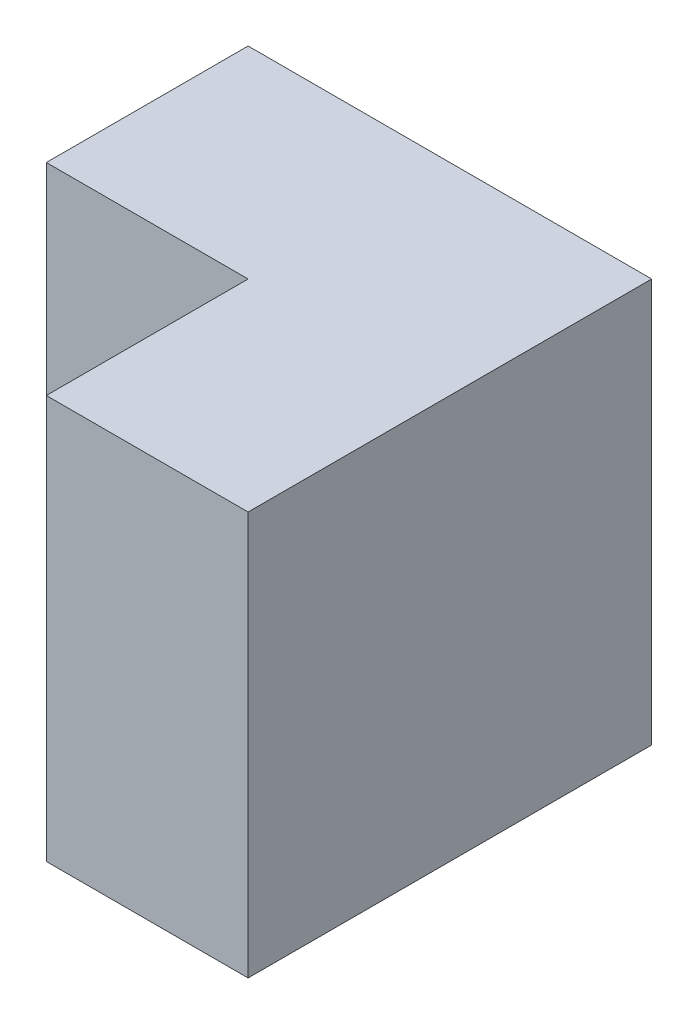
ISO-10303-21;
HEADER;
FILE_DESCRIPTION(('STEP AP214'),'2;1');
FILE_NAME('part.step','',(''),(''),'','','');
FILE_SCHEMA(('AUTOMOTIVE_DESIGN { 1 0 10303 214 1 1 1 1 }'));
ENDSEC;
DATA;
#1=APPLICATION_CONTEXT('core data for automotive mechanical design processes');
#2=APPLICATION_PROTOCOL_DEFINITION('international standard','automotive_design',2000,#1);
#3=PRODUCT_CONTEXT('',#1,'mechanical');
#4=PRODUCT('Part','Part','',(#3));
#5=PRODUCT_RELATED_PRODUCT_CATEGORY('part','',(#4));
#6=PRODUCT_DEFINITION_FORMATION('','',#4);
#7=PRODUCT_DEFINITION_CONTEXT('part definition',#1,'design');
#8=PRODUCT_DEFINITION('design','',#6,#7);
#9=PRODUCT_DEFINITION_SHAPE('','',#8);
#10=(LENGTH_UNIT() NAMED_UNIT(*) SI_UNIT(.MILLI.,.METRE.));
#11=(NAMED_UNIT(*) PLANE_ANGLE_UNIT() SI_UNIT($,.RADIAN.));
#12=(NAMED_UNIT(*) SI_UNIT($,.STERADIAN.) SOLID_ANGLE_UNIT());
#13=UNCERTAINTY_MEASURE_WITH_UNIT(LENGTH_MEASURE(1.E-05),#10,'distance_accuracy_value','');
#14=(GEOMETRIC_REPRESENTATION_CONTEXT(3) GLOBAL_UNCERTAINTY_ASSIGNED_CONTEXT((#13)) GLOBAL_UNIT_ASSIGNED_CONTEXT((#10,
#11,#12)) REPRESENTATION_CONTEXT('',''));
#15=CARTESIAN_POINT('',(0.,0.,0.));
#16=DIRECTION('',(0.,0.,1.));
#17=DIRECTION('',(1.,0.,0.));
#18=AXIS2_PLACEMENT_3D('',#15,#16,#17);
#19=CARTESIAN_POINT('',(0.,0.,20.));
#20=DIRECTION('',(1.,0.,0.));
#21=DIRECTION('',(0.,0.,-1.));
#22=AXIS2_PLACEMENT_3D('',#19,#20,#21);
#23=PLANE('',#22);
#24=DIRECTION('',(0.,-1.,0.));
#25=VECTOR('',#24,1.);
#26=CARTESIAN_POINT('',(0.,20.,10.));
#27=LINE('',#26,#25);
#28=CARTESIAN_POINT('',(0.,20.,10.));
#29=VERTEX_POINT('',#28);
#30=CARTESIAN_POINT('',(0.,0.,10.));
#31=VERTEX_POINT('',#30);
#32=EDGE_CURVE('E81',#29,#31,#27,.T.);
#33=ORIENTED_EDGE('',*,*,#32,.F.);
#34=DIRECTION('',(0.,0.,-1.));
#35=VECTOR('',#34,1.);
#36=CARTESIAN_POINT('',(0.,20.,20.));
#37=LINE('',#36,#35);
#38=CARTESIAN_POINT('',(0.,20.,0.));
#39=VERTEX_POINT('',#38);
#40=EDGE_CURVE('E75',#29,#39,#37,.T.);
#41=ORIENTED_EDGE('',*,*,#40,.T.);
#42=DIRECTION('',(0.,-1.,0.));
#43=VECTOR('',#42,1.);
#44=CARTESIAN_POINT('',(0.,0.,0.));
#45=LINE('',#44,#43);
#46=CARTESIAN_POINT('',(0.,0.,0.));
#47=VERTEX_POINT('',#46);
#48=EDGE_CURVE('E79',#39,#47,#45,.T.);
#49=ORIENTED_EDGE('',*,*,#48,.T.);
#50=DIRECTION('',(0.,0.,-1.));
#51=VECTOR('',#50,1.);
#52=CARTESIAN_POINT('',(0.,0.,20.));
#53=LINE('',#52,#51);
#54=EDGE_CURVE('E11',#31,#47,#53,.T.);
#55=ORIENTED_EDGE('',*,*,#54,.F.);
#56=EDGE_LOOP('',(#33,#41,#49,#55));
#57=FACE_BOUND('',#56,.T.);
#58=ADVANCED_FACE('F33',(#57),#23,.F.);
#59=CARTESIAN_POINT('',(0.,0.,20.));
#60=DIRECTION('',(0.,1.,0.));
#61=DIRECTION('',(0.,0.,1.));
#62=AXIS2_PLACEMENT_3D('',#59,#60,#61);
#63=PLANE('',#62);
#64=DIRECTION('',(1.,0.,0.));
#65=VECTOR('',#64,1.);
#66=CARTESIAN_POINT('',(0.,0.,20.));
#67=LINE('',#66,#65);
#68=CARTESIAN_POINT('',(10.,0.,20.));
#69=VERTEX_POINT('',#68);
#70=CARTESIAN_POINT('',(20.,0.,20.));
#71=VERTEX_POINT('',#70);
#72=EDGE_CURVE('E94',#69,#71,#67,.T.);
#73=ORIENTED_EDGE('',*,*,#72,.F.);
#74=DIRECTION('',(0.,0.,1.));
#75=VECTOR('',#74,1.);
#76=CARTESIAN_POINT('',(10.,0.,10.));
#77=LINE('',#76,#75);
#78=CARTESIAN_POINT('',(10.,0.,10.));
#79=VERTEX_POINT('',#78);
#80=EDGE_CURVE('E47',#79,#69,#77,.T.);
#81=ORIENTED_EDGE('',*,*,#80,.F.);
#82=DIRECTION('',(1.,0.,0.));
#83=VECTOR('',#82,1.);
#84=CARTESIAN_POINT('',(0.,0.,10.));
#85=LINE('',#84,#83);
#86=EDGE_CURVE('E119',#31,#79,#85,.T.);
#87=ORIENTED_EDGE('',*,*,#86,.F.);
#88=ORIENTED_EDGE('',*,*,#54,.T.);
#89=DIRECTION('',(1.,0.,0.));
#90=VECTOR('',#89,1.);
#91=CARTESIAN_POINT('',(0.,0.,0.));
#92=LINE('',#91,#90);
#93=CARTESIAN_POINT('',(20.,0.,0.));
#94=VERTEX_POINT('',#93);
#95=EDGE_CURVE('E99',#47,#94,#92,.T.);
#96=ORIENTED_EDGE('',*,*,#95,.T.);
#97=DIRECTION('',(0.,0.,-1.));
#98=VECTOR('',#97,1.);
#99=CARTESIAN_POINT('',(20.,0.,20.));
#100=LINE('',#99,#98);
#101=EDGE_CURVE('E40',#71,#94,#100,.T.);
#102=ORIENTED_EDGE('',*,*,#101,.F.);
#103=EDGE_LOOP('',(#73,#81,#87,#88,#96,#102));
#104=FACE_BOUND('',#103,.T.);
#105=ADVANCED_FACE('F115',(#104),#63,.F.);
#106=CARTESIAN_POINT('',(20.,0.,20.));
#107=DIRECTION('',(-1.,0.,0.));
#108=DIRECTION('',(0.,0.,1.));
#109=AXIS2_PLACEMENT_3D('',#106,#107,#108);
#110=PLANE('',#109);
#111=DIRECTION('',(0.,1.,0.));
#112=VECTOR('',#111,1.);
#113=CARTESIAN_POINT('',(20.,0.,0.));
#114=LINE('',#113,#112);
#115=CARTESIAN_POINT('',(20.,20.,0.));
#116=VERTEX_POINT('',#115);
#117=EDGE_CURVE('E95',#94,#116,#114,.T.);
#118=ORIENTED_EDGE('',*,*,#117,.T.);
#119=DIRECTION('',(0.,0.,-1.));
#120=VECTOR('',#119,1.);
#121=CARTESIAN_POINT('',(20.,20.,20.));
#122=LINE('',#121,#120);
#123=CARTESIAN_POINT('',(20.,20.,20.));
#124=VERTEX_POINT('',#123);
#125=EDGE_CURVE('E84',#124,#116,#122,.T.);
#126=ORIENTED_EDGE('',*,*,#125,.F.);
#127=DIRECTION('',(0.,1.,0.));
#128=VECTOR('',#127,1.);
#129=CARTESIAN_POINT('',(20.,0.,20.));
#130=LINE('',#129,#128);
#131=EDGE_CURVE('E56',#71,#124,#130,.T.);
#132=ORIENTED_EDGE('',*,*,#131,.F.);
#133=ORIENTED_EDGE('',*,*,#101,.T.);
#134=EDGE_LOOP('',(#118,#126,#132,#133));
#135=FACE_BOUND('',#134,.T.);
#136=ADVANCED_FACE('F112',(#135),#110,.F.);
#137=CARTESIAN_POINT('',(0.,20.,20.));
#138=DIRECTION('',(0.,-1.,0.));
#139=DIRECTION('',(0.,0.,-1.));
#140=AXIS2_PLACEMENT_3D('',#137,#138,#139);
#141=PLANE('',#140);
#142=DIRECTION('',(-1.,0.,0.));
#143=VECTOR('',#142,1.);
#144=CARTESIAN_POINT('',(0.,20.,10.));
#145=LINE('',#144,#143);
#146=CARTESIAN_POINT('',(10.,20.,10.));
#147=VERTEX_POINT('',#146);
#148=EDGE_CURVE('E131',#147,#29,#145,.T.);
#149=ORIENTED_EDGE('',*,*,#148,.F.);
#150=DIRECTION('',(0.,0.,1.));
#151=VECTOR('',#150,1.);
#152=CARTESIAN_POINT('',(10.,20.,10.));
#153=LINE('',#152,#151);
#154=CARTESIAN_POINT('',(10.,20.,20.));
#155=VERTEX_POINT('',#154);
#156=EDGE_CURVE('E100',#147,#155,#153,.T.);
#157=ORIENTED_EDGE('',*,*,#156,.T.);
#158=DIRECTION('',(-1.,0.,0.));
#159=VECTOR('',#158,1.);
#160=CARTESIAN_POINT('',(0.,20.,20.));
#161=LINE('',#160,#159);
#162=EDGE_CURVE('E85',#124,#155,#161,.T.);
#163=ORIENTED_EDGE('',*,*,#162,.F.);
#164=ORIENTED_EDGE('',*,*,#125,.T.);
#165=DIRECTION('',(-1.,0.,0.));
#166=VECTOR('',#165,1.);
#167=CARTESIAN_POINT('',(0.,20.,0.));
#168=LINE('',#167,#166);
#169=EDGE_CURVE('E89',#116,#39,#168,.T.);
#170=ORIENTED_EDGE('',*,*,#169,.T.);
#171=ORIENTED_EDGE('',*,*,#40,.F.);
#172=EDGE_LOOP('',(#149,#157,#163,#164,#170,#171));
#173=FACE_BOUND('',#172,.T.);
#174=ADVANCED_FACE('F90',(#173),#141,.F.);
#175=CARTESIAN_POINT('',(0.,0.,20.));
#176=DIRECTION('',(0.,0.,-1.));
#177=DIRECTION('',(-1.,0.,0.));
#178=AXIS2_PLACEMENT_3D('',#175,#176,#177);
#179=PLANE('',#178);
#180=ORIENTED_EDGE('',*,*,#162,.T.);
#181=DIRECTION('',(0.,1.,0.));
#182=VECTOR('',#181,1.);
#183=CARTESIAN_POINT('',(10.,20.,20.));
#184=LINE('',#183,#182);
#185=EDGE_CURVE('E139',#69,#155,#184,.T.);
#186=ORIENTED_EDGE('',*,*,#185,.F.);
#187=ORIENTED_EDGE('',*,*,#72,.T.);
#188=ORIENTED_EDGE('',*,*,#131,.T.);
#189=EDGE_LOOP('',(#180,#186,#187,#188));
#190=FACE_BOUND('',#189,.T.);
#191=ADVANCED_FACE('F141',(#190),#179,.F.);
#192=CARTESIAN_POINT('',(0.,0.,0.));
#193=DIRECTION('',(0.,0.,-1.));
#194=DIRECTION('',(-1.,0.,0.));
#195=AXIS2_PLACEMENT_3D('',#192,#193,#194);
#196=PLANE('',#195);
#197=ORIENTED_EDGE('',*,*,#48,.F.);
#198=ORIENTED_EDGE('',*,*,#169,.F.);
#199=ORIENTED_EDGE('',*,*,#117,.F.);
#200=ORIENTED_EDGE('',*,*,#95,.F.);
#201=EDGE_LOOP('',(#197,#198,#199,#200));
#202=FACE_BOUND('',#201,.T.);
#203=ADVANCED_FACE('F98',(#202),#196,.T.);
#204=CARTESIAN_POINT('',(10.,20.,10.));
#205=DIRECTION('',(1.,0.,0.));
#206=DIRECTION('',(0.,1.,0.));
#207=AXIS2_PLACEMENT_3D('',#204,#205,#206);
#208=PLANE('',#207);
#209=ORIENTED_EDGE('',*,*,#185,.T.);
#210=ORIENTED_EDGE('',*,*,#156,.F.);
#211=DIRECTION('',(0.,1.,0.));
#212=VECTOR('',#211,1.);
#213=CARTESIAN_POINT('',(10.,20.,10.));
#214=LINE('',#213,#212);
#215=EDGE_CURVE('E133',#79,#147,#214,.T.);
#216=ORIENTED_EDGE('',*,*,#215,.F.);
#217=ORIENTED_EDGE('',*,*,#80,.T.);
#218=EDGE_LOOP('',(#209,#210,#216,#217));
#219=FACE_BOUND('',#218,.T.);
#220=ADVANCED_FACE('F142',(#219),#208,.F.);
#221=CARTESIAN_POINT('',(0.,0.,10.));
#222=DIRECTION('',(0.,0.,1.));
#223=DIRECTION('',(1.,0.,0.));
#224=AXIS2_PLACEMENT_3D('',#221,#222,#223);
#225=PLANE('',#224);
#226=ORIENTED_EDGE('',*,*,#32,.T.);
#227=ORIENTED_EDGE('',*,*,#86,.T.);
#228=ORIENTED_EDGE('',*,*,#215,.T.);
#229=ORIENTED_EDGE('',*,*,#148,.T.);
#230=EDGE_LOOP('',(#226,#227,#228,#229));
#231=FACE_BOUND('',#230,.T.);
#232=ADVANCED_FACE('F132',(#231),#225,.T.);
#233=CLOSED_SHELL('',(#58,#105,#136,#174,#191,#203,#220,#232));
#234=MANIFOLD_SOLID_BREP('B2',#233);
#235=ADVANCED_BREP_SHAPE_REPRESENTATION('',(#18,#234),#14);
#236=SHAPE_DEFINITION_REPRESENTATION(#9,#235);
ENDSEC;
END-ISO-10303-21;
